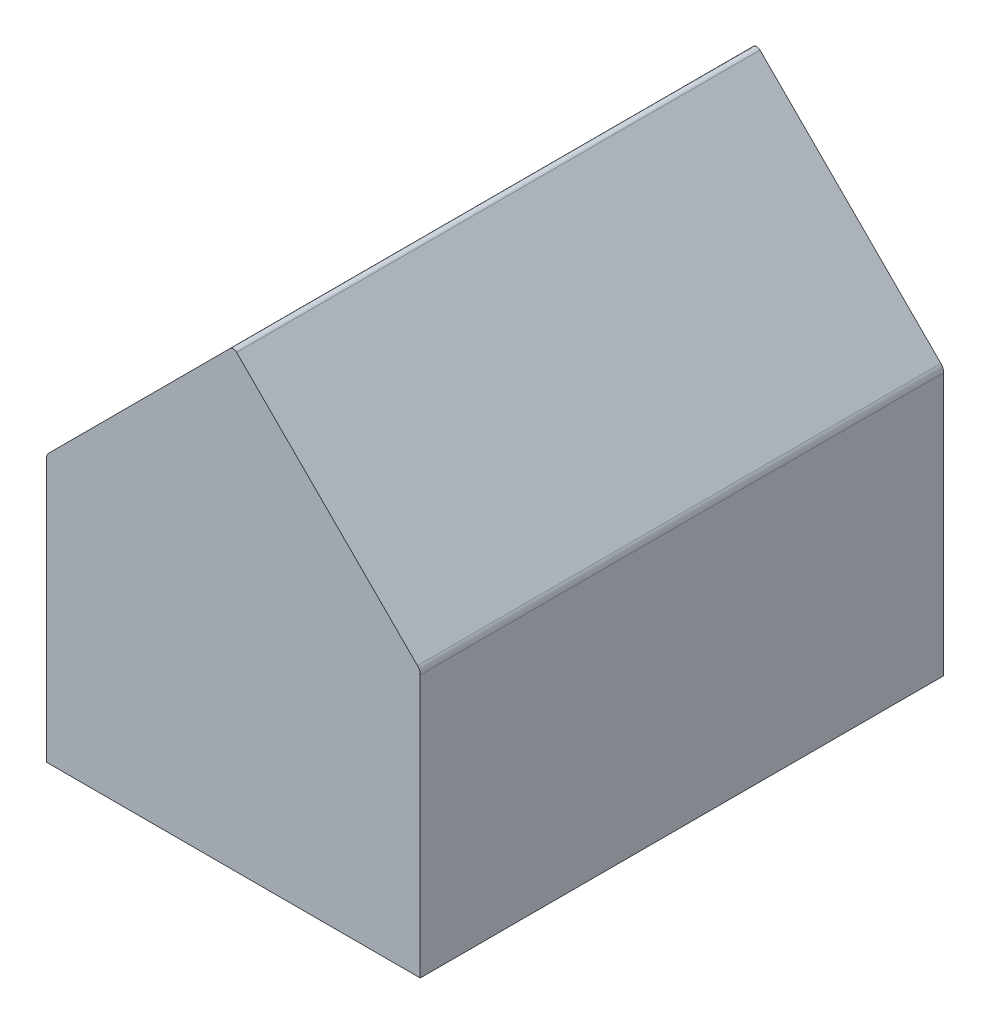
ISO-10303-21;
HEADER;
FILE_DESCRIPTION(('STEP AP214'),'2;1');
FILE_NAME('part.step','',(''),(''),'','','');
FILE_SCHEMA(('AUTOMOTIVE_DESIGN { 1 0 10303 214 1 1 1 1 }'));
ENDSEC;
DATA;
#1=APPLICATION_CONTEXT('core data for automotive mechanical design processes');
#2=APPLICATION_PROTOCOL_DEFINITION('international standard','automotive_design',2000,#1);
#3=PRODUCT_CONTEXT('',#1,'mechanical');
#4=PRODUCT('Part','Part','',(#3));
#5=PRODUCT_RELATED_PRODUCT_CATEGORY('part','',(#4));
#6=PRODUCT_DEFINITION_FORMATION('','',#4);
#7=PRODUCT_DEFINITION_CONTEXT('part definition',#1,'design');
#8=PRODUCT_DEFINITION('design','',#6,#7);
#9=PRODUCT_DEFINITION_SHAPE('','',#8);
#10=(LENGTH_UNIT() NAMED_UNIT(*) SI_UNIT(.MILLI.,.METRE.));
#11=(NAMED_UNIT(*) PLANE_ANGLE_UNIT() SI_UNIT($,.RADIAN.));
#12=(NAMED_UNIT(*) SI_UNIT($,.STERADIAN.) SOLID_ANGLE_UNIT());
#13=UNCERTAINTY_MEASURE_WITH_UNIT(LENGTH_MEASURE(1.E-05),#10,'distance_accuracy_value','');
#14=(GEOMETRIC_REPRESENTATION_CONTEXT(3) GLOBAL_UNCERTAINTY_ASSIGNED_CONTEXT((#13)) GLOBAL_UNIT_ASSIGNED_CONTEXT((#10,
#11,#12)) REPRESENTATION_CONTEXT('',''));
#15=CARTESIAN_POINT('',(0.,0.,0.));
#16=DIRECTION('',(0.,0.,1.));
#17=DIRECTION('',(1.,0.,0.));
#18=AXIS2_PLACEMENT_3D('',#15,#16,#17);
#19=CARTESIAN_POINT('',(4.34975000000001,4.34974999999999,7.112));
#20=DIRECTION('',(0.707106781186549,0.707106781186546,0.));
#21=DIRECTION('',(-0.707106781186546,0.707106781186549,0.));
#22=AXIS2_PLACEMENT_3D('',#19,#20,#21);
#23=PLANE('',#22);
#24=DIRECTION('',(0.707106781186546,-0.707106781186549,0.));
#25=VECTOR('',#24,1.);
#26=CARTESIAN_POINT('',(4.34975000000001,4.34974999999999,-7.112));
#27=LINE('',#26,#25);
#28=CARTESIAN_POINT('',(0.0898025612106916,8.60969743878932,-7.112));
#29=VERTEX_POINT('',#28);
#30=CARTESIAN_POINT('',(5.00560512242138,3.69389487757861,-7.112));
#31=VERTEX_POINT('',#30);
#32=EDGE_CURVE('E142',#29,#31,#27,.T.);
#33=ORIENTED_EDGE('',*,*,#32,.F.);
#34=DIRECTION('',(0.,0.,-1.));
#35=VECTOR('',#34,1.);
#36=CARTESIAN_POINT('',(0.0898025612106916,8.60969743878932,7.112));
#37=LINE('',#36,#35);
#38=CARTESIAN_POINT('',(0.0898025612106916,8.60969743878932,7.112));
#39=VERTEX_POINT('',#38);
#40=EDGE_CURVE('E50',#29,#39,#37,.F.);
#41=ORIENTED_EDGE('',*,*,#40,.T.);
#42=DIRECTION('',(0.707106781186546,-0.707106781186549,0.));
#43=VECTOR('',#42,1.);
#44=CARTESIAN_POINT('',(4.34975000000001,4.34974999999999,7.112));
#45=LINE('',#44,#43);
#46=CARTESIAN_POINT('',(5.00560512242138,3.69389487757861,7.112));
#47=VERTEX_POINT('',#46);
#48=EDGE_CURVE('E156',#39,#47,#45,.T.);
#49=ORIENTED_EDGE('',*,*,#48,.T.);
#50=DIRECTION('',(0.,0.,-1.));
#51=VECTOR('',#50,1.);
#52=CARTESIAN_POINT('',(5.00560512242138,3.69389487757861,7.112));
#53=LINE('',#52,#51);
#54=EDGE_CURVE('E130',#47,#31,#53,.T.);
#55=ORIENTED_EDGE('',*,*,#54,.T.);
#56=EDGE_LOOP('',(#33,#41,#49,#55));
#57=FACE_BOUND('',#56,.T.);
#58=ADVANCED_FACE('F41',(#57),#23,.T.);
#59=CARTESIAN_POINT('',(-4.34975,4.34974999999999,7.112));
#60=DIRECTION('',(-0.707106781186549,0.707106781186546,0.));
#61=DIRECTION('',(-0.707106781186546,-0.707106781186549,0.));
#62=AXIS2_PLACEMENT_3D('',#59,#60,#61);
#63=PLANE('',#62);
#64=DIRECTION('',(0.707106781186546,0.707106781186549,0.));
#65=VECTOR('',#64,1.);
#66=CARTESIAN_POINT('',(-4.34975,4.34974999999999,7.112));
#67=LINE('',#66,#65);
#68=CARTESIAN_POINT('',(-5.00560512242138,3.69389487757861,7.112));
#69=VERTEX_POINT('',#68);
#70=CARTESIAN_POINT('',(-0.0898025612106898,8.60969743878932,7.112));
#71=VERTEX_POINT('',#70);
#72=EDGE_CURVE('E119',#69,#71,#67,.T.);
#73=ORIENTED_EDGE('',*,*,#72,.T.);
#74=DIRECTION('',(0.,0.,-1.));
#75=VECTOR('',#74,1.);
#76=CARTESIAN_POINT('',(-0.089802561210689,8.60969743878932,7.112));
#77=LINE('',#76,#75);
#78=CARTESIAN_POINT('',(-0.0898025612106898,8.60969743878932,-7.112));
#79=VERTEX_POINT('',#78);
#80=EDGE_CURVE('E183',#71,#79,#77,.T.);
#81=ORIENTED_EDGE('',*,*,#80,.T.);
#82=DIRECTION('',(0.707106781186546,0.707106781186549,0.));
#83=VECTOR('',#82,1.);
#84=CARTESIAN_POINT('',(-4.34975,4.34974999999999,-7.112));
#85=LINE('',#84,#83);
#86=CARTESIAN_POINT('',(-5.00560512242138,3.69389487757861,-7.112));
#87=VERTEX_POINT('',#86);
#88=EDGE_CURVE('E145',#87,#79,#85,.T.);
#89=ORIENTED_EDGE('',*,*,#88,.F.);
#90=DIRECTION('',(0.,0.,-1.));
#91=VECTOR('',#90,1.);
#92=CARTESIAN_POINT('',(-5.00560512242138,3.69389487757861,7.112));
#93=LINE('',#92,#91);
#94=EDGE_CURVE('E180',#87,#69,#93,.F.);
#95=ORIENTED_EDGE('',*,*,#94,.T.);
#96=EDGE_LOOP('',(#73,#81,#89,#95));
#97=FACE_BOUND('',#96,.T.);
#98=ADVANCED_FACE('F193',(#97),#63,.T.);
#99=CARTESIAN_POINT('',(-5.08,0.,7.112));
#100=DIRECTION('',(1.,0.,0.));
#101=DIRECTION('',(0.,0.,-1.));
#102=AXIS2_PLACEMENT_3D('',#99,#100,#101);
#103=PLANE('',#102);
#104=DIRECTION('',(0.,-1.,0.));
#105=VECTOR('',#104,1.);
#106=CARTESIAN_POINT('',(-5.08,0.,7.112));
#107=LINE('',#106,#105);
#108=CARTESIAN_POINT('',(-5.08,3.51428975515723,7.112));
#109=VERTEX_POINT('',#108);
#110=CARTESIAN_POINT('',(-5.08,-3.61949999999999,7.112));
#111=VERTEX_POINT('',#110);
#112=EDGE_CURVE('E105',#109,#111,#107,.T.);
#113=ORIENTED_EDGE('',*,*,#112,.F.);
#114=DIRECTION('',(0.,0.,-1.));
#115=VECTOR('',#114,1.);
#116=CARTESIAN_POINT('',(-5.08,3.51428975515723,-7.112));
#117=LINE('',#116,#115);
#118=CARTESIAN_POINT('',(-5.08,3.51428975515723,-7.112));
#119=VERTEX_POINT('',#118);
#120=EDGE_CURVE('E177',#109,#119,#117,.T.);
#121=ORIENTED_EDGE('',*,*,#120,.T.);
#122=DIRECTION('',(0.,-1.,0.));
#123=VECTOR('',#122,1.);
#124=CARTESIAN_POINT('',(-5.08,0.,-7.112));
#125=LINE('',#124,#123);
#126=CARTESIAN_POINT('',(-5.08,-3.61949999999999,-7.112));
#127=VERTEX_POINT('',#126);
#128=EDGE_CURVE('E125',#119,#127,#125,.T.);
#129=ORIENTED_EDGE('',*,*,#128,.T.);
#130=DIRECTION('',(0.,0.,-1.));
#131=VECTOR('',#130,1.);
#132=CARTESIAN_POINT('',(-5.08,-3.61949999999999,7.112));
#133=LINE('',#132,#131);
#134=EDGE_CURVE('E122',#111,#127,#133,.T.);
#135=ORIENTED_EDGE('',*,*,#134,.F.);
#136=EDGE_LOOP('',(#113,#121,#129,#135));
#137=FACE_BOUND('',#136,.T.);
#138=ADVANCED_FACE('F123',(#137),#103,.F.);
#139=CARTESIAN_POINT('',(0.,-3.61949999999999,7.112));
#140=DIRECTION('',(0.,1.,0.));
#141=DIRECTION('',(0.,0.,1.));
#142=AXIS2_PLACEMENT_3D('',#139,#140,#141);
#143=PLANE('',#142);
#144=DIRECTION('',(1.,0.,0.));
#145=VECTOR('',#144,1.);
#146=CARTESIAN_POINT('',(0.,-3.61949999999999,-7.112));
#147=LINE('',#146,#145);
#148=CARTESIAN_POINT('',(5.08,-3.61949999999999,-7.112));
#149=VERTEX_POINT('',#148);
#150=EDGE_CURVE('E150',#127,#149,#147,.T.);
#151=ORIENTED_EDGE('',*,*,#150,.T.);
#152=DIRECTION('',(0.,0.,-1.));
#153=VECTOR('',#152,1.);
#154=CARTESIAN_POINT('',(5.08,-3.61949999999999,7.112));
#155=LINE('',#154,#153);
#156=CARTESIAN_POINT('',(5.08,-3.61949999999999,7.112));
#157=VERTEX_POINT('',#156);
#158=EDGE_CURVE('E131',#157,#149,#155,.T.);
#159=ORIENTED_EDGE('',*,*,#158,.F.);
#160=DIRECTION('',(1.,0.,0.));
#161=VECTOR('',#160,1.);
#162=CARTESIAN_POINT('',(0.,-3.61949999999999,7.112));
#163=LINE('',#162,#161);
#164=EDGE_CURVE('E110',#111,#157,#163,.T.);
#165=ORIENTED_EDGE('',*,*,#164,.F.);
#166=ORIENTED_EDGE('',*,*,#134,.T.);
#167=EDGE_LOOP('',(#151,#159,#165,#166));
#168=FACE_BOUND('',#167,.T.);
#169=ADVANCED_FACE('F133',(#168),#143,.F.);
#170=CARTESIAN_POINT('',(5.08,0.,7.112));
#171=DIRECTION('',(1.,0.,0.));
#172=DIRECTION('',(0.,0.,-1.));
#173=AXIS2_PLACEMENT_3D('',#170,#171,#172);
#174=PLANE('',#173);
#175=DIRECTION('',(0.,-1.,0.));
#176=VECTOR('',#175,1.);
#177=CARTESIAN_POINT('',(5.08,0.,-7.112));
#178=LINE('',#177,#176);
#179=CARTESIAN_POINT('',(5.08,3.51428975515723,-7.112));
#180=VERTEX_POINT('',#179);
#181=EDGE_CURVE('E153',#180,#149,#178,.T.);
#182=ORIENTED_EDGE('',*,*,#181,.F.);
#183=DIRECTION('',(0.,0.,-1.));
#184=VECTOR('',#183,1.);
#185=CARTESIAN_POINT('',(5.08,3.51428975515723,7.112));
#186=LINE('',#185,#184);
#187=CARTESIAN_POINT('',(5.08,3.51428975515723,7.112));
#188=VERTEX_POINT('',#187);
#189=EDGE_CURVE('E168',#180,#188,#186,.F.);
#190=ORIENTED_EDGE('',*,*,#189,.T.);
#191=DIRECTION('',(0.,-1.,0.));
#192=VECTOR('',#191,1.);
#193=CARTESIAN_POINT('',(5.08,0.,7.112));
#194=LINE('',#193,#192);
#195=EDGE_CURVE('E136',#188,#157,#194,.T.);
#196=ORIENTED_EDGE('',*,*,#195,.T.);
#197=ORIENTED_EDGE('',*,*,#158,.T.);
#198=EDGE_LOOP('',(#182,#190,#196,#197));
#199=FACE_BOUND('',#198,.T.);
#200=ADVANCED_FACE('F211',(#199),#174,.T.);
#201=CARTESIAN_POINT('',(0.,0.,7.112));
#202=DIRECTION('',(0.,0.,1.));
#203=DIRECTION('',(1.,0.,0.));
#204=AXIS2_PLACEMENT_3D('',#201,#202,#203);
#205=PLANE('',#204);
#206=ORIENTED_EDGE('',*,*,#48,.F.);
#207=CARTESIAN_POINT('',(0.,8.51989487757863,7.112));
#208=DIRECTION('',(0.,0.,1.));
#209=DIRECTION('',(1.,0.,0.));
#210=AXIS2_PLACEMENT_3D('',#207,#208,#209);
#211=CIRCLE('',#210,0.127);
#212=EDGE_CURVE('E11',#39,#71,#211,.T.);
#213=ORIENTED_EDGE('',*,*,#212,.T.);
#214=ORIENTED_EDGE('',*,*,#72,.F.);
#215=CARTESIAN_POINT('',(-4.826,3.51428975515723,7.112));
#216=DIRECTION('',(0.,0.,1.));
#217=DIRECTION('',(1.,0.,0.));
#218=AXIS2_PLACEMENT_3D('',#215,#216,#217);
#219=CIRCLE('',#218,0.254);
#220=EDGE_CURVE('E114',#69,#109,#219,.T.);
#221=ORIENTED_EDGE('',*,*,#220,.T.);
#222=ORIENTED_EDGE('',*,*,#112,.T.);
#223=ORIENTED_EDGE('',*,*,#164,.T.);
#224=ORIENTED_EDGE('',*,*,#195,.F.);
#225=CARTESIAN_POINT('',(4.826,3.51428975515723,7.112));
#226=DIRECTION('',(0.,0.,1.));
#227=DIRECTION('',(1.,0.,0.));
#228=AXIS2_PLACEMENT_3D('',#225,#226,#227);
#229=CIRCLE('',#228,0.254);
#230=EDGE_CURVE('E173',#188,#47,#229,.T.);
#231=ORIENTED_EDGE('',*,*,#230,.T.);
#232=EDGE_LOOP('',(#206,#213,#214,#221,#222,#223,#224,#231));
#233=FACE_BOUND('',#232,.T.);
#234=ADVANCED_FACE('F107',(#233),#205,.T.);
#235=CARTESIAN_POINT('',(0.,0.,-7.112));
#236=DIRECTION('',(0.,0.,1.));
#237=DIRECTION('',(1.,0.,0.));
#238=AXIS2_PLACEMENT_3D('',#235,#236,#237);
#239=PLANE('',#238);
#240=ORIENTED_EDGE('',*,*,#88,.T.);
#241=CARTESIAN_POINT('',(0.,8.51989487757863,-7.112));
#242=DIRECTION('',(0.,0.,1.));
#243=DIRECTION('',(1.,0.,0.));
#244=AXIS2_PLACEMENT_3D('',#241,#242,#243);
#245=CIRCLE('',#244,0.127);
#246=EDGE_CURVE('E64',#79,#29,#245,.F.);
#247=ORIENTED_EDGE('',*,*,#246,.T.);
#248=ORIENTED_EDGE('',*,*,#32,.T.);
#249=CARTESIAN_POINT('',(4.826,3.51428975515723,-7.112));
#250=DIRECTION('',(0.,0.,1.));
#251=DIRECTION('',(1.,0.,0.));
#252=AXIS2_PLACEMENT_3D('',#249,#250,#251);
#253=CIRCLE('',#252,0.254);
#254=EDGE_CURVE('E165',#31,#180,#253,.F.);
#255=ORIENTED_EDGE('',*,*,#254,.T.);
#256=ORIENTED_EDGE('',*,*,#181,.T.);
#257=ORIENTED_EDGE('',*,*,#150,.F.);
#258=ORIENTED_EDGE('',*,*,#128,.F.);
#259=CARTESIAN_POINT('',(-4.826,3.51428975515723,-7.112));
#260=DIRECTION('',(0.,0.,1.));
#261=DIRECTION('',(1.,0.,0.));
#262=AXIS2_PLACEMENT_3D('',#259,#260,#261);
#263=CIRCLE('',#262,0.254);
#264=EDGE_CURVE('E162',#119,#87,#263,.F.);
#265=ORIENTED_EDGE('',*,*,#264,.T.);
#266=EDGE_LOOP('',(#240,#247,#248,#255,#256,#257,#258,#265));
#267=FACE_BOUND('',#266,.T.);
#268=ADVANCED_FACE('F197',(#267),#239,.F.);
#269=CARTESIAN_POINT('',(4.826,3.51428975515723,7.112));
#270=DIRECTION('',(0.,0.,-1.));
#271=DIRECTION('',(-1.,0.,0.));
#272=AXIS2_PLACEMENT_3D('',#269,#270,#271);
#273=CYLINDRICAL_SURFACE('',#272,0.254);
#274=ORIENTED_EDGE('',*,*,#230,.F.);
#275=ORIENTED_EDGE('',*,*,#189,.F.);
#276=ORIENTED_EDGE('',*,*,#254,.F.);
#277=ORIENTED_EDGE('',*,*,#54,.F.);
#278=EDGE_LOOP('',(#274,#275,#276,#277));
#279=FACE_BOUND('',#278,.T.);
#280=ADVANCED_FACE('F208',(#279),#273,.T.);
#281=CARTESIAN_POINT('',(-4.826,3.51428975515723,7.112));
#282=DIRECTION('',(0.,0.,1.));
#283=DIRECTION('',(1.,0.,0.));
#284=AXIS2_PLACEMENT_3D('',#281,#282,#283);
#285=CYLINDRICAL_SURFACE('',#284,0.254);
#286=ORIENTED_EDGE('',*,*,#220,.F.);
#287=ORIENTED_EDGE('',*,*,#94,.F.);
#288=ORIENTED_EDGE('',*,*,#264,.F.);
#289=ORIENTED_EDGE('',*,*,#120,.F.);
#290=EDGE_LOOP('',(#286,#287,#288,#289));
#291=FACE_BOUND('',#290,.T.);
#292=ADVANCED_FACE('F199',(#291),#285,.T.);
#293=CARTESIAN_POINT('',(0.,8.51989487757863,7.112));
#294=DIRECTION('',(0.,0.,-1.));
#295=DIRECTION('',(-1.,0.,0.));
#296=AXIS2_PLACEMENT_3D('',#293,#294,#295);
#297=CYLINDRICAL_SURFACE('',#296,0.127);
#298=ORIENTED_EDGE('',*,*,#212,.F.);
#299=ORIENTED_EDGE('',*,*,#40,.F.);
#300=ORIENTED_EDGE('',*,*,#246,.F.);
#301=ORIENTED_EDGE('',*,*,#80,.F.);
#302=EDGE_LOOP('',(#298,#299,#300,#301));
#303=FACE_BOUND('',#302,.T.);
#304=ADVANCED_FACE('F43',(#303),#297,.T.);
#305=CLOSED_SHELL('',(#58,#98,#138,#169,#200,#234,#268,#280,#292,#304));
#306=MANIFOLD_SOLID_BREP('B2',#305);
#307=ADVANCED_BREP_SHAPE_REPRESENTATION('',(#18,#306),#14);
#308=SHAPE_DEFINITION_REPRESENTATION(#9,#307);
ENDSEC;
END-ISO-10303-21;
